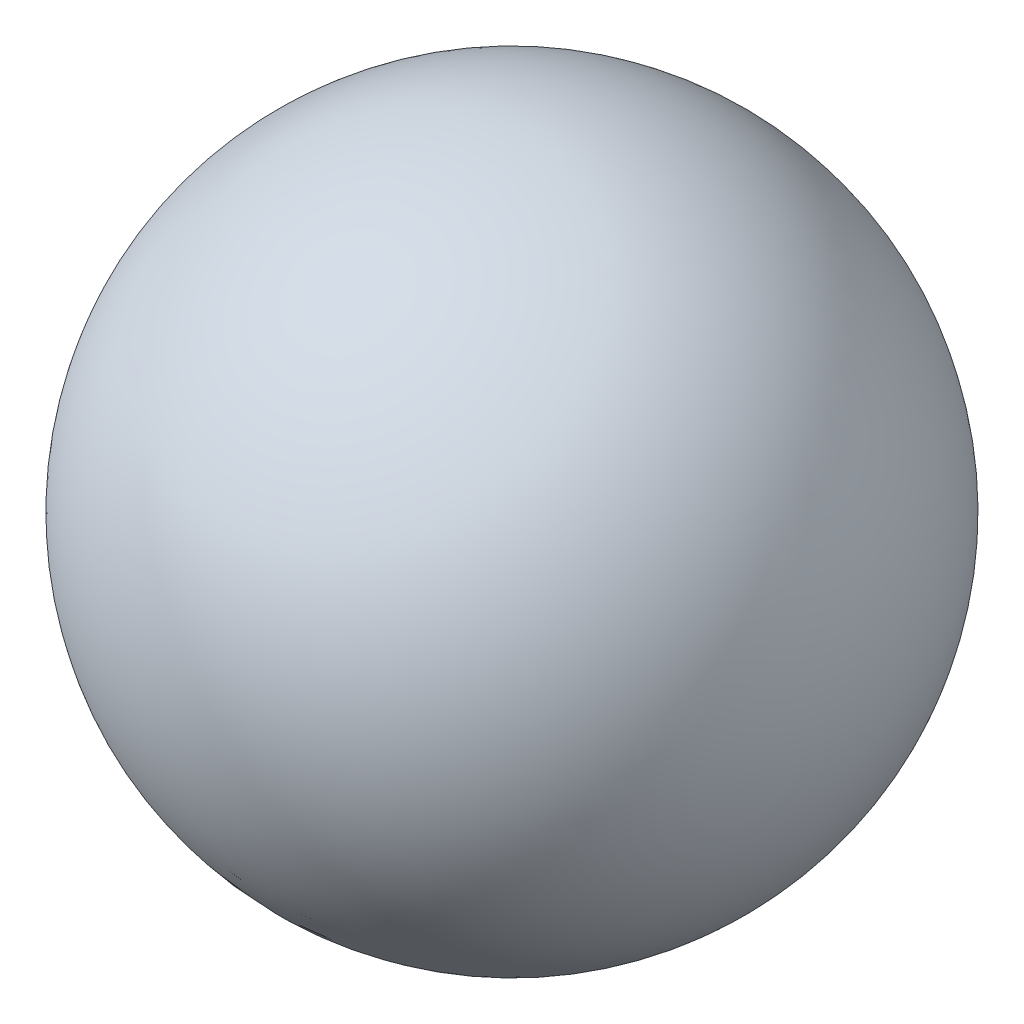
ISO-10303-21;
HEADER;
FILE_DESCRIPTION(('STEP AP214'),'2;1');
FILE_NAME('part.step','',(''),(''),'','','');
FILE_SCHEMA(('AUTOMOTIVE_DESIGN { 1 0 10303 214 1 1 1 1 }'));
ENDSEC;
DATA;
#1=APPLICATION_CONTEXT('core data for automotive mechanical design processes');
#2=APPLICATION_PROTOCOL_DEFINITION('international standard','automotive_design',2000,#1);
#3=PRODUCT_CONTEXT('',#1,'mechanical');
#4=PRODUCT('Part','Part','',(#3));
#5=PRODUCT_RELATED_PRODUCT_CATEGORY('part','',(#4));
#6=PRODUCT_DEFINITION_FORMATION('','',#4);
#7=PRODUCT_DEFINITION_CONTEXT('part definition',#1,'design');
#8=PRODUCT_DEFINITION('design','',#6,#7);
#9=PRODUCT_DEFINITION_SHAPE('','',#8);
#10=(LENGTH_UNIT() NAMED_UNIT(*) SI_UNIT(.MILLI.,.METRE.));
#11=(NAMED_UNIT(*) PLANE_ANGLE_UNIT() SI_UNIT($,.RADIAN.));
#12=(NAMED_UNIT(*) SI_UNIT($,.STERADIAN.) SOLID_ANGLE_UNIT());
#13=UNCERTAINTY_MEASURE_WITH_UNIT(LENGTH_MEASURE(1.E-05),#10,'distance_accuracy_value','');
#14=(GEOMETRIC_REPRESENTATION_CONTEXT(3) GLOBAL_UNCERTAINTY_ASSIGNED_CONTEXT((#13)) GLOBAL_UNIT_ASSIGNED_CONTEXT((#10,
#11,#12)) REPRESENTATION_CONTEXT('',''));
#15=CARTESIAN_POINT('',(0.,0.,0.));
#16=DIRECTION('',(0.,0.,1.));
#17=DIRECTION('',(1.,0.,0.));
#18=AXIS2_PLACEMENT_3D('',#15,#16,#17);
#19=CARTESIAN_POINT('',(0.,0.,0.));
#20=DIRECTION('',(0.4478903305047,0.656115274052428,0.607377147245019));
#21=DIRECTION('',(0.0100088860330754,-0.682962360251249,0.730384992096921));
#22=AXIS2_PLACEMENT_3D('',#19,#20,#21);
#23=SPHERICAL_SURFACE('',#22,1.1905);
#24=CARTESIAN_POINT('',(-0.533213438465846,-0.781105233759416,-0.723082493795195));
#25=VERTEX_POINT('',#24);
#26=VERTEX_LOOP('',#25);
#27=FACE_BOUND('',#26,.T.);
#28=CARTESIAN_POINT('',(0.533213438465846,0.781105233759416,0.723082493795195));
#29=VERTEX_POINT('',#28);
#30=VERTEX_LOOP('',#29);
#31=FACE_BOUND('',#30,.T.);
#32=ADVANCED_FACE('F15',(#27,#31),#23,.T.);
#33=CLOSED_SHELL('',(#32));
#34=MANIFOLD_SOLID_BREP('B1',#33);
#35=ADVANCED_BREP_SHAPE_REPRESENTATION('',(#18,#34),#14);
#36=SHAPE_DEFINITION_REPRESENTATION(#9,#35);
ENDSEC;
END-ISO-10303-21;
